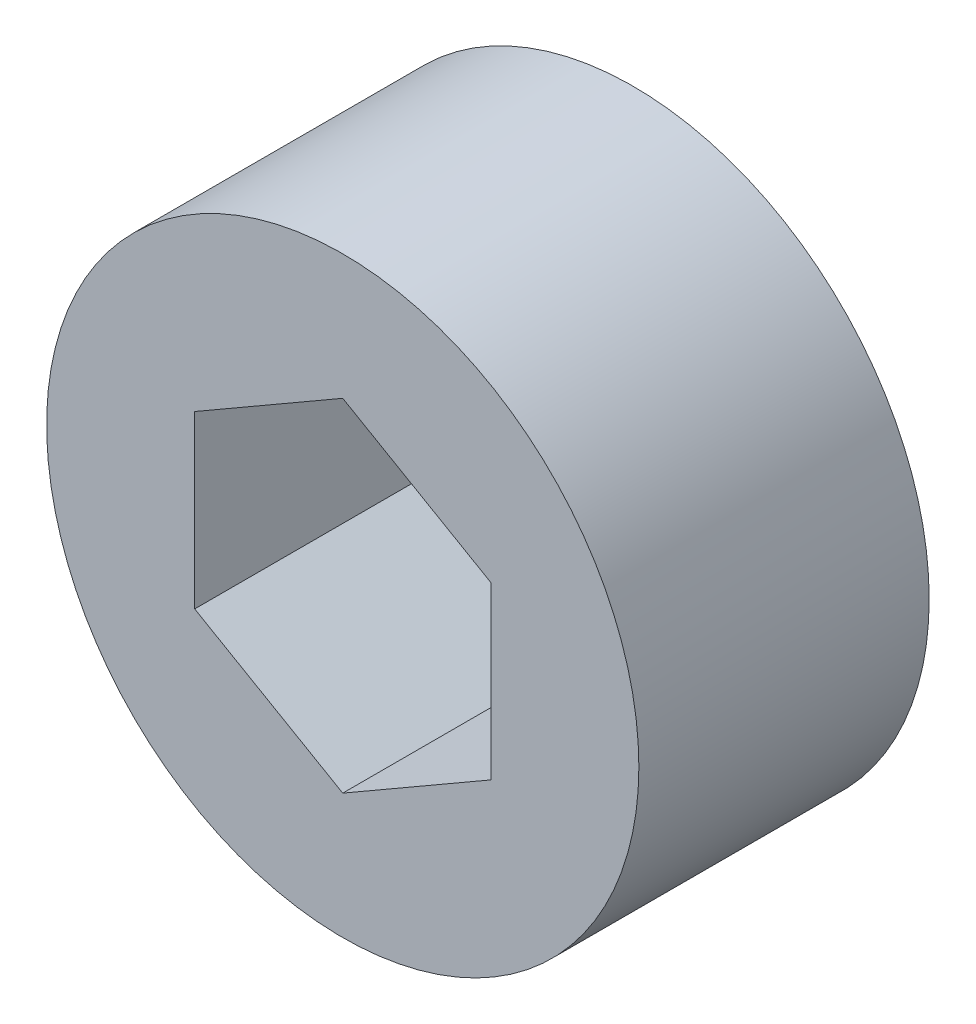
ISO-10303-21;
HEADER;
FILE_DESCRIPTION(('STEP AP214'),'2;1');
FILE_NAME('part.step','',(''),(''),'','','');
FILE_SCHEMA(('AUTOMOTIVE_DESIGN { 1 0 10303 214 1 1 1 1 }'));
ENDSEC;
DATA;
#1=APPLICATION_CONTEXT('core data for automotive mechanical design processes');
#2=APPLICATION_PROTOCOL_DEFINITION('international standard','automotive_design',2000,#1);
#3=PRODUCT_CONTEXT('',#1,'mechanical');
#4=PRODUCT('Part','Part','',(#3));
#5=PRODUCT_RELATED_PRODUCT_CATEGORY('part','',(#4));
#6=PRODUCT_DEFINITION_FORMATION('','',#4);
#7=PRODUCT_DEFINITION_CONTEXT('part definition',#1,'design');
#8=PRODUCT_DEFINITION('design','',#6,#7);
#9=PRODUCT_DEFINITION_SHAPE('','',#8);
#10=(LENGTH_UNIT() NAMED_UNIT(*) SI_UNIT(.MILLI.,.METRE.));
#11=(NAMED_UNIT(*) PLANE_ANGLE_UNIT() SI_UNIT($,.RADIAN.));
#12=(NAMED_UNIT(*) SI_UNIT($,.STERADIAN.) SOLID_ANGLE_UNIT());
#13=UNCERTAINTY_MEASURE_WITH_UNIT(LENGTH_MEASURE(1.E-05),#10,'distance_accuracy_value','');
#14=(GEOMETRIC_REPRESENTATION_CONTEXT(3) GLOBAL_UNCERTAINTY_ASSIGNED_CONTEXT((#13)) GLOBAL_UNIT_ASSIGNED_CONTEXT((#10,
#11,#12)) REPRESENTATION_CONTEXT('',''));
#15=CARTESIAN_POINT('',(0.,0.,0.));
#16=DIRECTION('',(0.,0.,1.));
#17=DIRECTION('',(1.,0.,0.));
#18=AXIS2_PLACEMENT_3D('',#15,#16,#17);
#19=CARTESIAN_POINT('',(0.,0.,6.35));
#20=DIRECTION('',(0.,0.,-1.));
#21=DIRECTION('',(-1.,0.,0.));
#22=AXIS2_PLACEMENT_3D('',#19,#20,#21);
#23=CYLINDRICAL_SURFACE('',#22,6.477);
#24=CARTESIAN_POINT('',(0.,0.,6.35));
#25=DIRECTION('',(0.,0.,1.));
#26=DIRECTION('',(1.,0.,0.));
#27=AXIS2_PLACEMENT_3D('',#24,#25,#26);
#28=CIRCLE('',#27,6.477);
#29=CARTESIAN_POINT('',(6.477,0.,6.35));
#30=VERTEX_POINT('',#29);
#31=EDGE_CURVE('E11',#30,#30,#28,.T.);
#32=ORIENTED_EDGE('',*,*,#31,.F.);
#33=EDGE_LOOP('',(#32));
#34=FACE_BOUND('',#33,.T.);
#35=CARTESIAN_POINT('',(0.,0.,0.));
#36=DIRECTION('',(0.,0.,1.));
#37=DIRECTION('',(1.,0.,0.));
#38=AXIS2_PLACEMENT_3D('',#35,#36,#37);
#39=CIRCLE('',#38,6.477);
#40=CARTESIAN_POINT('',(6.477,0.,0.));
#41=VERTEX_POINT('',#40);
#42=EDGE_CURVE('E42',#41,#41,#39,.T.);
#43=ORIENTED_EDGE('',*,*,#42,.T.);
#44=EDGE_LOOP('',(#43));
#45=FACE_BOUND('',#44,.T.);
#46=ADVANCED_FACE('F39',(#34,#45),#23,.T.);
#47=CARTESIAN_POINT('',(0.,0.,6.35));
#48=DIRECTION('',(0.,0.,1.));
#49=DIRECTION('',(1.,0.,0.));
#50=AXIS2_PLACEMENT_3D('',#47,#48,#49);
#51=PLANE('',#50);
#52=DIRECTION('',(0.,1.,0.));
#53=VECTOR('',#52,1.);
#54=CARTESIAN_POINT('',(3.2385,-1.8697488467706,6.35));
#55=LINE('',#54,#53);
#56=CARTESIAN_POINT('',(3.2385,-1.8697488467706,6.35));
#57=VERTEX_POINT('',#56);
#58=CARTESIAN_POINT('',(3.2385,1.8697488467706,6.35));
#59=VERTEX_POINT('',#58);
#60=EDGE_CURVE('E53',#57,#59,#55,.T.);
#61=ORIENTED_EDGE('',*,*,#60,.F.);
#62=DIRECTION('',(0.866025403784438,0.5,0.));
#63=VECTOR('',#62,1.);
#64=CARTESIAN_POINT('',(0.,-3.73949769354121,6.35));
#65=LINE('',#64,#63);
#66=CARTESIAN_POINT('',(0.,-3.73949769354121,6.35));
#67=VERTEX_POINT('',#66);
#68=EDGE_CURVE('E112',#67,#57,#65,.T.);
#69=ORIENTED_EDGE('',*,*,#68,.F.);
#70=DIRECTION('',(0.866025403784439,-0.5,0.));
#71=VECTOR('',#70,1.);
#72=CARTESIAN_POINT('',(-3.2385,-1.8697488467706,6.35));
#73=LINE('',#72,#71);
#74=CARTESIAN_POINT('',(-3.2385,-1.8697488467706,6.35));
#75=VERTEX_POINT('',#74);
#76=EDGE_CURVE('E115',#75,#67,#73,.T.);
#77=ORIENTED_EDGE('',*,*,#76,.F.);
#78=DIRECTION('',(0.,-1.,0.));
#79=VECTOR('',#78,1.);
#80=CARTESIAN_POINT('',(-3.2385,1.8697488467706,6.35));
#81=LINE('',#80,#79);
#82=CARTESIAN_POINT('',(-3.2385,1.8697488467706,6.35));
#83=VERTEX_POINT('',#82);
#84=EDGE_CURVE('E133',#83,#75,#81,.T.);
#85=ORIENTED_EDGE('',*,*,#84,.F.);
#86=DIRECTION('',(-0.866025403784439,-0.5,0.));
#87=VECTOR('',#86,1.);
#88=CARTESIAN_POINT('',(0.,3.7394976935412,6.35));
#89=LINE('',#88,#87);
#90=CARTESIAN_POINT('',(0.,3.7394976935412,6.35));
#91=VERTEX_POINT('',#90);
#92=EDGE_CURVE('E130',#91,#83,#89,.T.);
#93=ORIENTED_EDGE('',*,*,#92,.F.);
#94=DIRECTION('',(-0.866025403784439,0.5,0.));
#95=VECTOR('',#94,1.);
#96=CARTESIAN_POINT('',(3.2385,1.8697488467706,6.35));
#97=LINE('',#96,#95);
#98=EDGE_CURVE('E128',#59,#91,#97,.T.);
#99=ORIENTED_EDGE('',*,*,#98,.F.);
#100=EDGE_LOOP('',(#61,#69,#77,#85,#93,#99));
#101=FACE_BOUND('',#100,.T.);
#102=ORIENTED_EDGE('',*,*,#31,.T.);
#103=EDGE_LOOP('',(#102));
#104=FACE_BOUND('',#103,.T.);
#105=ADVANCED_FACE('F154',(#101,#104),#51,.T.);
#106=CARTESIAN_POINT('',(0.,0.,0.));
#107=DIRECTION('',(0.,0.,1.));
#108=DIRECTION('',(1.,0.,0.));
#109=AXIS2_PLACEMENT_3D('',#106,#107,#108);
#110=PLANE('',#109);
#111=DIRECTION('',(0.866025403784438,0.5,0.));
#112=VECTOR('',#111,1.);
#113=CARTESIAN_POINT('',(0.,-3.73949769354121,0.));
#114=LINE('',#113,#112);
#115=CARTESIAN_POINT('',(0.,-3.73949769354121,0.));
#116=VERTEX_POINT('',#115);
#117=CARTESIAN_POINT('',(3.2385,-1.8697488467706,0.));
#118=VERTEX_POINT('',#117);
#119=EDGE_CURVE('E101',#116,#118,#114,.T.);
#120=ORIENTED_EDGE('',*,*,#119,.T.);
#121=DIRECTION('',(0.,1.,0.));
#122=VECTOR('',#121,1.);
#123=CARTESIAN_POINT('',(3.2385,-1.8697488467706,0.));
#124=LINE('',#123,#122);
#125=CARTESIAN_POINT('',(3.2385,1.8697488467706,0.));
#126=VERTEX_POINT('',#125);
#127=EDGE_CURVE('E95',#118,#126,#124,.T.);
#128=ORIENTED_EDGE('',*,*,#127,.T.);
#129=DIRECTION('',(-0.866025403784439,0.5,0.));
#130=VECTOR('',#129,1.);
#131=CARTESIAN_POINT('',(3.2385,1.8697488467706,0.));
#132=LINE('',#131,#130);
#133=CARTESIAN_POINT('',(0.,3.7394976935412,0.));
#134=VERTEX_POINT('',#133);
#135=EDGE_CURVE('E104',#126,#134,#132,.T.);
#136=ORIENTED_EDGE('',*,*,#135,.T.);
#137=DIRECTION('',(-0.866025403784439,-0.5,0.));
#138=VECTOR('',#137,1.);
#139=CARTESIAN_POINT('',(0.,3.7394976935412,0.));
#140=LINE('',#139,#138);
#141=CARTESIAN_POINT('',(-3.2385,1.8697488467706,0.));
#142=VERTEX_POINT('',#141);
#143=EDGE_CURVE('E61',#134,#142,#140,.T.);
#144=ORIENTED_EDGE('',*,*,#143,.T.);
#145=DIRECTION('',(0.,-1.,0.));
#146=VECTOR('',#145,1.);
#147=CARTESIAN_POINT('',(-3.2385,1.8697488467706,0.));
#148=LINE('',#147,#146);
#149=CARTESIAN_POINT('',(-3.2385,-1.8697488467706,0.));
#150=VERTEX_POINT('',#149);
#151=EDGE_CURVE('E120',#142,#150,#148,.T.);
#152=ORIENTED_EDGE('',*,*,#151,.T.);
#153=DIRECTION('',(0.866025403784439,-0.5,0.));
#154=VECTOR('',#153,1.);
#155=CARTESIAN_POINT('',(-3.2385,-1.8697488467706,0.));
#156=LINE('',#155,#154);
#157=EDGE_CURVE('E124',#150,#116,#156,.T.);
#158=ORIENTED_EDGE('',*,*,#157,.T.);
#159=EDGE_LOOP('',(#120,#128,#136,#144,#152,#158));
#160=FACE_BOUND('',#159,.T.);
#161=ORIENTED_EDGE('',*,*,#42,.F.);
#162=EDGE_LOOP('',(#161));
#163=FACE_BOUND('',#162,.T.);
#164=ADVANCED_FACE('F108',(#160,#163),#110,.F.);
#165=CARTESIAN_POINT('',(3.2385,-1.8697488467706,0.));
#166=DIRECTION('',(1.,0.,0.));
#167=DIRECTION('',(0.,1.,0.));
#168=AXIS2_PLACEMENT_3D('',#165,#166,#167);
#169=PLANE('',#168);
#170=ORIENTED_EDGE('',*,*,#60,.T.);
#171=DIRECTION('',(0.,0.,1.));
#172=VECTOR('',#171,1.);
#173=CARTESIAN_POINT('',(3.2385,1.8697488467706,0.));
#174=LINE('',#173,#172);
#175=EDGE_CURVE('E91',#126,#59,#174,.T.);
#176=ORIENTED_EDGE('',*,*,#175,.F.);
#177=ORIENTED_EDGE('',*,*,#127,.F.);
#178=DIRECTION('',(0.,0.,1.));
#179=VECTOR('',#178,1.);
#180=CARTESIAN_POINT('',(3.2385,-1.8697488467706,0.));
#181=LINE('',#180,#179);
#182=EDGE_CURVE('E140',#118,#57,#181,.T.);
#183=ORIENTED_EDGE('',*,*,#182,.T.);
#184=EDGE_LOOP('',(#170,#176,#177,#183));
#185=FACE_BOUND('',#184,.T.);
#186=ADVANCED_FACE('F93',(#185),#169,.F.);
#187=CARTESIAN_POINT('',(0.,-3.73949769354121,0.));
#188=DIRECTION('',(0.5,-0.866025403784438,0.));
#189=DIRECTION('',(0.866025403784439,0.5,0.));
#190=AXIS2_PLACEMENT_3D('',#187,#188,#189);
#191=PLANE('',#190);
#192=ORIENTED_EDGE('',*,*,#68,.T.);
#193=ORIENTED_EDGE('',*,*,#182,.F.);
#194=ORIENTED_EDGE('',*,*,#119,.F.);
#195=DIRECTION('',(0.,0.,1.));
#196=VECTOR('',#195,1.);
#197=CARTESIAN_POINT('',(0.,-3.73949769354121,0.));
#198=LINE('',#197,#196);
#199=EDGE_CURVE('E142',#116,#67,#198,.T.);
#200=ORIENTED_EDGE('',*,*,#199,.T.);
#201=EDGE_LOOP('',(#192,#193,#194,#200));
#202=FACE_BOUND('',#201,.T.);
#203=ADVANCED_FACE('F165',(#202),#191,.F.);
#204=CARTESIAN_POINT('',(-3.2385,-1.8697488467706,0.));
#205=DIRECTION('',(-0.5,-0.866025403784439,0.));
#206=DIRECTION('',(0.866025403784439,-0.5,0.));
#207=AXIS2_PLACEMENT_3D('',#204,#205,#206);
#208=PLANE('',#207);
#209=ORIENTED_EDGE('',*,*,#76,.T.);
#210=ORIENTED_EDGE('',*,*,#199,.F.);
#211=ORIENTED_EDGE('',*,*,#157,.F.);
#212=DIRECTION('',(0.,0.,1.));
#213=VECTOR('',#212,1.);
#214=CARTESIAN_POINT('',(-3.2385,-1.8697488467706,0.));
#215=LINE('',#214,#213);
#216=EDGE_CURVE('E144',#150,#75,#215,.T.);
#217=ORIENTED_EDGE('',*,*,#216,.T.);
#218=EDGE_LOOP('',(#209,#210,#211,#217));
#219=FACE_BOUND('',#218,.T.);
#220=ADVANCED_FACE('F163',(#219),#208,.F.);
#221=CARTESIAN_POINT('',(-3.2385,1.8697488467706,0.));
#222=DIRECTION('',(-1.,0.,0.));
#223=DIRECTION('',(0.,0.,1.));
#224=AXIS2_PLACEMENT_3D('',#221,#222,#223);
#225=PLANE('',#224);
#226=ORIENTED_EDGE('',*,*,#84,.T.);
#227=ORIENTED_EDGE('',*,*,#216,.F.);
#228=ORIENTED_EDGE('',*,*,#151,.F.);
#229=DIRECTION('',(0.,0.,1.));
#230=VECTOR('',#229,1.);
#231=CARTESIAN_POINT('',(-3.2385,1.8697488467706,0.));
#232=LINE('',#231,#230);
#233=EDGE_CURVE('E147',#142,#83,#232,.T.);
#234=ORIENTED_EDGE('',*,*,#233,.T.);
#235=EDGE_LOOP('',(#226,#227,#228,#234));
#236=FACE_BOUND('',#235,.T.);
#237=ADVANCED_FACE('F159',(#236),#225,.F.);
#238=CARTESIAN_POINT('',(0.,3.7394976935412,0.));
#239=DIRECTION('',(-0.5,0.866025403784439,0.));
#240=DIRECTION('',(-0.866025403784439,-0.5,0.));
#241=AXIS2_PLACEMENT_3D('',#238,#239,#240);
#242=PLANE('',#241);
#243=ORIENTED_EDGE('',*,*,#92,.T.);
#244=ORIENTED_EDGE('',*,*,#233,.F.);
#245=ORIENTED_EDGE('',*,*,#143,.F.);
#246=DIRECTION('',(0.,0.,1.));
#247=VECTOR('',#246,1.);
#248=CARTESIAN_POINT('',(0.,3.7394976935412,0.));
#249=LINE('',#248,#247);
#250=EDGE_CURVE('E100',#134,#91,#249,.T.);
#251=ORIENTED_EDGE('',*,*,#250,.T.);
#252=EDGE_LOOP('',(#243,#244,#245,#251));
#253=FACE_BOUND('',#252,.T.);
#254=ADVANCED_FACE('F150',(#253),#242,.F.);
#255=CARTESIAN_POINT('',(3.2385,1.8697488467706,0.));
#256=DIRECTION('',(0.5,0.866025403784439,0.));
#257=DIRECTION('',(-0.866025403784439,0.5,0.));
#258=AXIS2_PLACEMENT_3D('',#255,#256,#257);
#259=PLANE('',#258);
#260=ORIENTED_EDGE('',*,*,#98,.T.);
#261=ORIENTED_EDGE('',*,*,#250,.F.);
#262=ORIENTED_EDGE('',*,*,#135,.F.);
#263=ORIENTED_EDGE('',*,*,#175,.T.);
#264=EDGE_LOOP('',(#260,#261,#262,#263));
#265=FACE_BOUND('',#264,.T.);
#266=ADVANCED_FACE('F105',(#265),#259,.F.);
#267=CLOSED_SHELL('',(#46,#105,#164,#186,#203,#220,#237,#254,#266));
#268=MANIFOLD_SOLID_BREP('B2',#267);
#269=ADVANCED_BREP_SHAPE_REPRESENTATION('',(#18,#268),#14);
#270=SHAPE_DEFINITION_REPRESENTATION(#9,#269);
ENDSEC;
END-ISO-10303-21;
